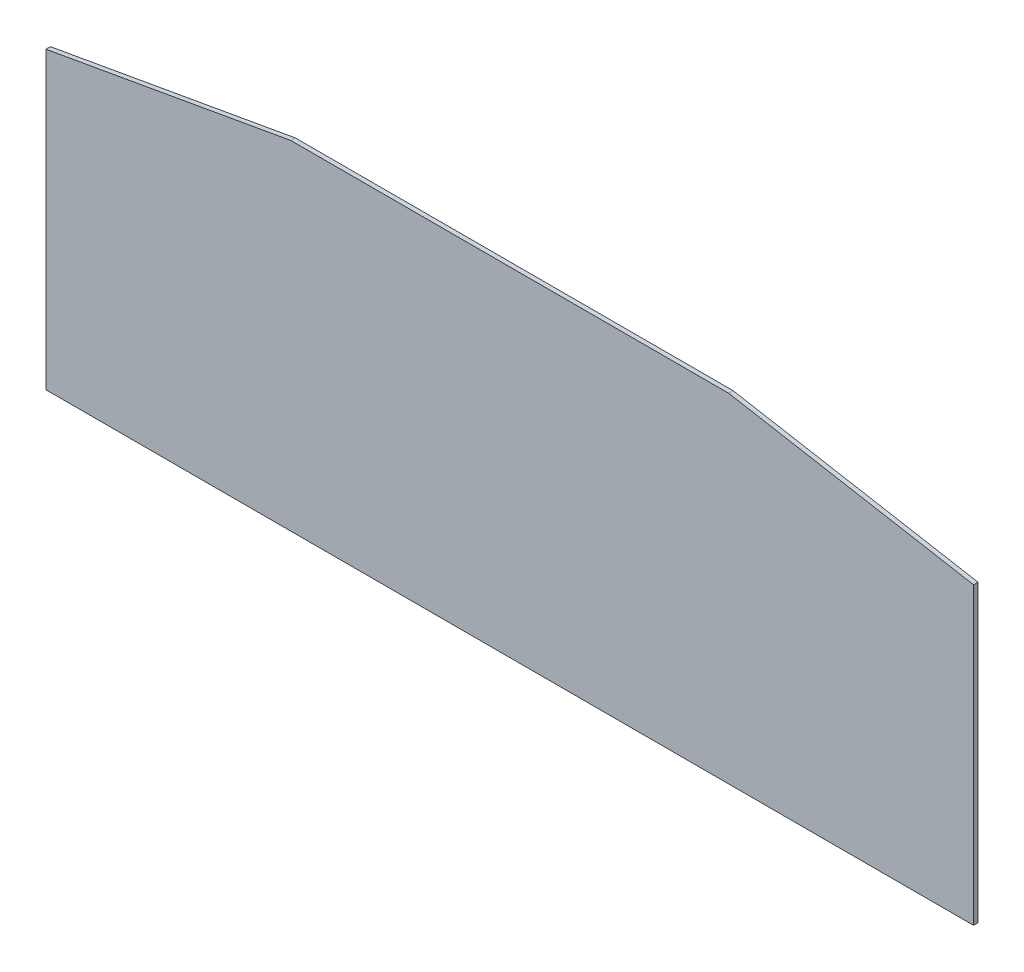
ISO-10303-21;
HEADER;
FILE_DESCRIPTION(('STEP AP214'),'2;1');
FILE_NAME('part.step','',(''),(''),'','','');
FILE_SCHEMA(('AUTOMOTIVE_DESIGN { 1 0 10303 214 1 1 1 1 }'));
ENDSEC;
DATA;
#1=APPLICATION_CONTEXT('core data for automotive mechanical design processes');
#2=APPLICATION_PROTOCOL_DEFINITION('international standard','automotive_design',2000,#1);
#3=PRODUCT_CONTEXT('',#1,'mechanical');
#4=PRODUCT('Part','Part','',(#3));
#5=PRODUCT_RELATED_PRODUCT_CATEGORY('part','',(#4));
#6=PRODUCT_DEFINITION_FORMATION('','',#4);
#7=PRODUCT_DEFINITION_CONTEXT('part definition',#1,'design');
#8=PRODUCT_DEFINITION('design','',#6,#7);
#9=PRODUCT_DEFINITION_SHAPE('','',#8);
#10=(LENGTH_UNIT() NAMED_UNIT(*) SI_UNIT(.MILLI.,.METRE.));
#11=(NAMED_UNIT(*) PLANE_ANGLE_UNIT() SI_UNIT($,.RADIAN.));
#12=(NAMED_UNIT(*) SI_UNIT($,.STERADIAN.) SOLID_ANGLE_UNIT());
#13=UNCERTAINTY_MEASURE_WITH_UNIT(LENGTH_MEASURE(1.E-05),#10,'distance_accuracy_value','');
#14=(GEOMETRIC_REPRESENTATION_CONTEXT(3) GLOBAL_UNCERTAINTY_ASSIGNED_CONTEXT((#13)) GLOBAL_UNIT_ASSIGNED_CONTEXT((#10,
#11,#12)) REPRESENTATION_CONTEXT('',''));
#15=CARTESIAN_POINT('',(0.,0.,0.));
#16=DIRECTION('',(0.,0.,1.));
#17=DIRECTION('',(1.,0.,0.));
#18=AXIS2_PLACEMENT_3D('',#15,#16,#17);
#19=CARTESIAN_POINT('',(2500.,-3.82820902550103E-13,-12.));
#20=DIRECTION('',(0.,-1.,0.));
#21=DIRECTION('',(1.,0.,0.));
#22=AXIS2_PLACEMENT_3D('',#19,#20,#21);
#23=PLANE('',#22);
#24=DIRECTION('',(1.,0.,0.));
#25=VECTOR('',#24,1.);
#26=CARTESIAN_POINT('',(2500.,-3.82820902550103E-13,0.));
#27=LINE('',#26,#25);
#28=CARTESIAN_POINT('',(0.,0.,0.));
#29=VERTEX_POINT('',#28);
#30=CARTESIAN_POINT('',(2500.,-3.82820902550103E-13,0.));
#31=VERTEX_POINT('',#30);
#32=EDGE_CURVE('E123',#29,#31,#27,.T.);
#33=ORIENTED_EDGE('',*,*,#32,.F.);
#34=DIRECTION('',(0.,0.,1.));
#35=VECTOR('',#34,1.);
#36=CARTESIAN_POINT('',(0.,0.,-12.));
#37=LINE('',#36,#35);
#38=CARTESIAN_POINT('',(0.,0.,-12.));
#39=VERTEX_POINT('',#38);
#40=EDGE_CURVE('E11',#39,#29,#37,.T.);
#41=ORIENTED_EDGE('',*,*,#40,.F.);
#42=DIRECTION('',(1.,0.,0.));
#43=VECTOR('',#42,1.);
#44=CARTESIAN_POINT('',(2500.,-3.82820902550103E-13,-12.));
#45=LINE('',#44,#43);
#46=CARTESIAN_POINT('',(2500.,-3.82820902550103E-13,-12.));
#47=VERTEX_POINT('',#46);
#48=EDGE_CURVE('E137',#39,#47,#45,.T.);
#49=ORIENTED_EDGE('',*,*,#48,.T.);
#50=DIRECTION('',(0.,0.,1.));
#51=VECTOR('',#50,1.);
#52=CARTESIAN_POINT('',(2500.,-3.82820902550103E-13,-12.));
#53=LINE('',#52,#51);
#54=EDGE_CURVE('E41',#47,#31,#53,.T.);
#55=ORIENTED_EDGE('',*,*,#54,.T.);
#56=EDGE_LOOP('',(#33,#41,#49,#55));
#57=FACE_BOUND('',#56,.T.);
#58=ADVANCED_FACE('F38',(#57),#23,.T.);
#59=CARTESIAN_POINT('',(0.,0.,-12.));
#60=DIRECTION('',(-1.,0.,0.));
#61=DIRECTION('',(0.,0.,1.));
#62=AXIS2_PLACEMENT_3D('',#59,#60,#61);
#63=PLANE('',#62);
#64=DIRECTION('',(0.,-1.,0.));
#65=VECTOR('',#64,1.);
#66=CARTESIAN_POINT('',(0.,0.,0.));
#67=LINE('',#66,#65);
#68=CARTESIAN_POINT('',(0.,795.,0.));
#69=VERTEX_POINT('',#68);
#70=EDGE_CURVE('E135',#69,#29,#67,.T.);
#71=ORIENTED_EDGE('',*,*,#70,.F.);
#72=DIRECTION('',(0.,0.,1.));
#73=VECTOR('',#72,1.);
#74=CARTESIAN_POINT('',(0.,795.,-12.));
#75=LINE('',#74,#73);
#76=CARTESIAN_POINT('',(0.,795.,-12.));
#77=VERTEX_POINT('',#76);
#78=EDGE_CURVE('E47',#77,#69,#75,.T.);
#79=ORIENTED_EDGE('',*,*,#78,.F.);
#80=DIRECTION('',(0.,-1.,0.));
#81=VECTOR('',#80,1.);
#82=CARTESIAN_POINT('',(0.,0.,-12.));
#83=LINE('',#82,#81);
#84=EDGE_CURVE('E113',#77,#39,#83,.T.);
#85=ORIENTED_EDGE('',*,*,#84,.T.);
#86=ORIENTED_EDGE('',*,*,#40,.T.);
#87=EDGE_LOOP('',(#71,#79,#85,#86));
#88=FACE_BOUND('',#87,.T.);
#89=ADVANCED_FACE('F145',(#88),#63,.T.);
#90=CARTESIAN_POINT('',(0.,795.,-12.));
#91=DIRECTION('',(-0.174551252246048,0.984648089593097,0.));
#92=DIRECTION('',(-0.984648089593098,-0.174551252246048,0.));
#93=AXIS2_PLACEMENT_3D('',#90,#91,#92);
#94=PLANE('',#93);
#95=DIRECTION('',(-0.984648089593098,-0.174551252246048,0.));
#96=VECTOR('',#95,1.);
#97=CARTESIAN_POINT('',(0.,795.,0.));
#98=LINE('',#97,#96);
#99=CARTESIAN_POINT('',(660.,911.999999999999,0.));
#100=VERTEX_POINT('',#99);
#101=EDGE_CURVE('E100',#100,#69,#98,.T.);
#102=ORIENTED_EDGE('',*,*,#101,.F.);
#103=DIRECTION('',(0.,0.,1.));
#104=VECTOR('',#103,1.);
#105=CARTESIAN_POINT('',(660.,911.999999999999,-12.));
#106=LINE('',#105,#104);
#107=CARTESIAN_POINT('',(660.,911.999999999999,-12.));
#108=VERTEX_POINT('',#107);
#109=EDGE_CURVE('E95',#108,#100,#106,.T.);
#110=ORIENTED_EDGE('',*,*,#109,.F.);
#111=DIRECTION('',(-0.984648089593098,-0.174551252246048,0.));
#112=VECTOR('',#111,1.);
#113=CARTESIAN_POINT('',(0.,795.,-12.));
#114=LINE('',#113,#112);
#115=EDGE_CURVE('E98',#108,#77,#114,.T.);
#116=ORIENTED_EDGE('',*,*,#115,.T.);
#117=ORIENTED_EDGE('',*,*,#78,.T.);
#118=EDGE_LOOP('',(#102,#110,#116,#117));
#119=FACE_BOUND('',#118,.T.);
#120=ADVANCED_FACE('F97',(#119),#94,.T.);
#121=CARTESIAN_POINT('',(660.,911.999999999999,-12.));
#122=DIRECTION('',(0.,1.,0.));
#123=DIRECTION('',(-1.,0.,0.));
#124=AXIS2_PLACEMENT_3D('',#121,#122,#123);
#125=PLANE('',#124);
#126=DIRECTION('',(-1.,0.,0.));
#127=VECTOR('',#126,1.);
#128=CARTESIAN_POINT('',(660.,911.999999999999,0.));
#129=LINE('',#128,#127);
#130=CARTESIAN_POINT('',(1840.,911.999999999999,0.));
#131=VERTEX_POINT('',#130);
#132=EDGE_CURVE('E132',#131,#100,#129,.T.);
#133=ORIENTED_EDGE('',*,*,#132,.F.);
#134=DIRECTION('',(0.,0.,1.));
#135=VECTOR('',#134,1.);
#136=CARTESIAN_POINT('',(1840.,911.999999999999,-12.));
#137=LINE('',#136,#135);
#138=CARTESIAN_POINT('',(1840.,911.999999999999,-12.));
#139=VERTEX_POINT('',#138);
#140=EDGE_CURVE('E105',#139,#131,#137,.T.);
#141=ORIENTED_EDGE('',*,*,#140,.F.);
#142=DIRECTION('',(-1.,0.,0.));
#143=VECTOR('',#142,1.);
#144=CARTESIAN_POINT('',(660.,911.999999999999,-12.));
#145=LINE('',#144,#143);
#146=EDGE_CURVE('E111',#139,#108,#145,.T.);
#147=ORIENTED_EDGE('',*,*,#146,.T.);
#148=ORIENTED_EDGE('',*,*,#109,.T.);
#149=EDGE_LOOP('',(#133,#141,#147,#148));
#150=FACE_BOUND('',#149,.T.);
#151=ADVANCED_FACE('F115',(#150),#125,.T.);
#152=CARTESIAN_POINT('',(1840.,911.999999999999,-12.));
#153=DIRECTION('',(0.174551252246048,0.984648089593097,0.));
#154=DIRECTION('',(-0.984648089593098,0.174551252246048,0.));
#155=AXIS2_PLACEMENT_3D('',#152,#153,#154);
#156=PLANE('',#155);
#157=DIRECTION('',(-0.984648089593098,0.174551252246048,0.));
#158=VECTOR('',#157,1.);
#159=CARTESIAN_POINT('',(1840.,911.999999999999,0.));
#160=LINE('',#159,#158);
#161=CARTESIAN_POINT('',(2500.,795.,0.));
#162=VERTEX_POINT('',#161);
#163=EDGE_CURVE('E129',#162,#131,#160,.T.);
#164=ORIENTED_EDGE('',*,*,#163,.F.);
#165=DIRECTION('',(0.,0.,1.));
#166=VECTOR('',#165,1.);
#167=CARTESIAN_POINT('',(2500.,795.,-12.));
#168=LINE('',#167,#166);
#169=CARTESIAN_POINT('',(2500.,795.,-12.));
#170=VERTEX_POINT('',#169);
#171=EDGE_CURVE('E140',#170,#162,#168,.T.);
#172=ORIENTED_EDGE('',*,*,#171,.F.);
#173=DIRECTION('',(-0.984648089593098,0.174551252246048,0.));
#174=VECTOR('',#173,1.);
#175=CARTESIAN_POINT('',(1840.,911.999999999999,-12.));
#176=LINE('',#175,#174);
#177=EDGE_CURVE('E116',#170,#139,#176,.T.);
#178=ORIENTED_EDGE('',*,*,#177,.T.);
#179=ORIENTED_EDGE('',*,*,#140,.T.);
#180=EDGE_LOOP('',(#164,#172,#178,#179));
#181=FACE_BOUND('',#180,.T.);
#182=ADVANCED_FACE('F158',(#181),#156,.T.);
#183=CARTESIAN_POINT('',(2500.,795.,-12.));
#184=DIRECTION('',(1.,0.,0.));
#185=DIRECTION('',(0.,0.,-1.));
#186=AXIS2_PLACEMENT_3D('',#183,#184,#185);
#187=PLANE('',#186);
#188=DIRECTION('',(0.,1.,0.));
#189=VECTOR('',#188,1.);
#190=CARTESIAN_POINT('',(2500.,795.,0.));
#191=LINE('',#190,#189);
#192=EDGE_CURVE('E126',#31,#162,#191,.T.);
#193=ORIENTED_EDGE('',*,*,#192,.F.);
#194=ORIENTED_EDGE('',*,*,#54,.F.);
#195=DIRECTION('',(0.,1.,0.));
#196=VECTOR('',#195,1.);
#197=CARTESIAN_POINT('',(2500.,795.,-12.));
#198=LINE('',#197,#196);
#199=EDGE_CURVE('E118',#47,#170,#198,.T.);
#200=ORIENTED_EDGE('',*,*,#199,.T.);
#201=ORIENTED_EDGE('',*,*,#171,.T.);
#202=EDGE_LOOP('',(#193,#194,#200,#201));
#203=FACE_BOUND('',#202,.T.);
#204=ADVANCED_FACE('F142',(#203),#187,.T.);
#205=CARTESIAN_POINT('',(0.,0.,-12.));
#206=DIRECTION('',(0.,0.,-1.));
#207=DIRECTION('',(-1.,0.,0.));
#208=AXIS2_PLACEMENT_3D('',#205,#206,#207);
#209=PLANE('',#208);
#210=ORIENTED_EDGE('',*,*,#48,.F.);
#211=ORIENTED_EDGE('',*,*,#84,.F.);
#212=ORIENTED_EDGE('',*,*,#115,.F.);
#213=ORIENTED_EDGE('',*,*,#146,.F.);
#214=ORIENTED_EDGE('',*,*,#177,.F.);
#215=ORIENTED_EDGE('',*,*,#199,.F.);
#216=EDGE_LOOP('',(#210,#211,#212,#213,#214,#215));
#217=FACE_BOUND('',#216,.T.);
#218=ADVANCED_FACE('F109',(#217),#209,.T.);
#219=CARTESIAN_POINT('',(0.,0.,0.));
#220=DIRECTION('',(0.,0.,-1.));
#221=DIRECTION('',(-1.,0.,0.));
#222=AXIS2_PLACEMENT_3D('',#219,#220,#221);
#223=PLANE('',#222);
#224=ORIENTED_EDGE('',*,*,#32,.T.);
#225=ORIENTED_EDGE('',*,*,#192,.T.);
#226=ORIENTED_EDGE('',*,*,#163,.T.);
#227=ORIENTED_EDGE('',*,*,#132,.T.);
#228=ORIENTED_EDGE('',*,*,#101,.T.);
#229=ORIENTED_EDGE('',*,*,#70,.T.);
#230=EDGE_LOOP('',(#224,#225,#226,#227,#228,#229));
#231=FACE_BOUND('',#230,.T.);
#232=ADVANCED_FACE('F144',(#231),#223,.F.);
#233=CLOSED_SHELL('',(#58,#89,#120,#151,#182,#204,#218,#232));
#234=MANIFOLD_SOLID_BREP('B2',#233);
#235=ADVANCED_BREP_SHAPE_REPRESENTATION('',(#18,#234),#14);
#236=SHAPE_DEFINITION_REPRESENTATION(#9,#235);
ENDSEC;
END-ISO-10303-21;
